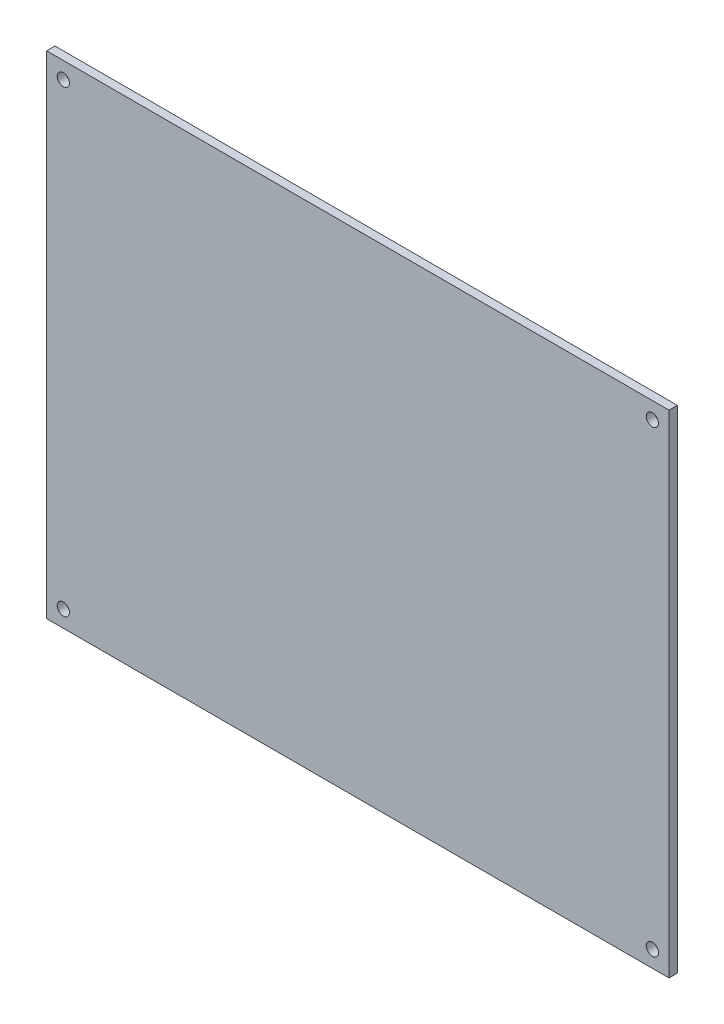
ISO-10303-21;
HEADER;
FILE_DESCRIPTION(('STEP AP214'),'2;1');
FILE_NAME('part.step','',(''),(''),'','','');
FILE_SCHEMA(('AUTOMOTIVE_DESIGN { 1 0 10303 214 1 1 1 1 }'));
ENDSEC;
DATA;
#1=APPLICATION_CONTEXT('core data for automotive mechanical design processes');
#2=APPLICATION_PROTOCOL_DEFINITION('international standard','automotive_design',2000,#1);
#3=PRODUCT_CONTEXT('',#1,'mechanical');
#4=PRODUCT('Part','Part','',(#3));
#5=PRODUCT_RELATED_PRODUCT_CATEGORY('part','',(#4));
#6=PRODUCT_DEFINITION_FORMATION('','',#4);
#7=PRODUCT_DEFINITION_CONTEXT('part definition',#1,'design');
#8=PRODUCT_DEFINITION('design','',#6,#7);
#9=PRODUCT_DEFINITION_SHAPE('','',#8);
#10=(LENGTH_UNIT() NAMED_UNIT(*) SI_UNIT(.MILLI.,.METRE.));
#11=(NAMED_UNIT(*) PLANE_ANGLE_UNIT() SI_UNIT($,.RADIAN.));
#12=(NAMED_UNIT(*) SI_UNIT($,.STERADIAN.) SOLID_ANGLE_UNIT());
#13=UNCERTAINTY_MEASURE_WITH_UNIT(LENGTH_MEASURE(1.E-05),#10,'distance_accuracy_value','');
#14=(GEOMETRIC_REPRESENTATION_CONTEXT(3) GLOBAL_UNCERTAINTY_ASSIGNED_CONTEXT((#13)) GLOBAL_UNIT_ASSIGNED_CONTEXT((#10,
#11,#12)) REPRESENTATION_CONTEXT('',''));
#15=CARTESIAN_POINT('',(0.,0.,0.));
#16=DIRECTION('',(0.,0.,1.));
#17=DIRECTION('',(1.,0.,0.));
#18=AXIS2_PLACEMENT_3D('',#15,#16,#17);
#19=CARTESIAN_POINT('',(56.,-44.25,1.5));
#20=DIRECTION('',(-1.,0.,0.));
#21=DIRECTION('',(0.,0.,1.));
#22=AXIS2_PLACEMENT_3D('',#19,#20,#21);
#23=PLANE('',#22);
#24=DIRECTION('',(0.,1.,0.));
#25=VECTOR('',#24,1.);
#26=CARTESIAN_POINT('',(56.,-44.25,0.));
#27=LINE('',#26,#25);
#28=CARTESIAN_POINT('',(56.,-44.25,0.));
#29=VERTEX_POINT('',#28);
#30=CARTESIAN_POINT('',(56.,44.25,0.));
#31=VERTEX_POINT('',#30);
#32=EDGE_CURVE('E98',#29,#31,#27,.T.);
#33=ORIENTED_EDGE('',*,*,#32,.T.);
#34=DIRECTION('',(0.,0.,-1.));
#35=VECTOR('',#34,1.);
#36=CARTESIAN_POINT('',(56.,44.25,1.5));
#37=LINE('',#36,#35);
#38=CARTESIAN_POINT('',(56.,44.25,1.5));
#39=VERTEX_POINT('',#38);
#40=EDGE_CURVE('E11',#39,#31,#37,.T.);
#41=ORIENTED_EDGE('',*,*,#40,.F.);
#42=DIRECTION('',(0.,1.,0.));
#43=VECTOR('',#42,1.);
#44=CARTESIAN_POINT('',(56.,-44.25,1.5));
#45=LINE('',#44,#43);
#46=CARTESIAN_POINT('',(56.,-44.25,1.5));
#47=VERTEX_POINT('',#46);
#48=EDGE_CURVE('E86',#47,#39,#45,.T.);
#49=ORIENTED_EDGE('',*,*,#48,.F.);
#50=DIRECTION('',(0.,0.,-1.));
#51=VECTOR('',#50,1.);
#52=CARTESIAN_POINT('',(56.,-44.25,1.5));
#53=LINE('',#52,#51);
#54=EDGE_CURVE('E94',#47,#29,#53,.T.);
#55=ORIENTED_EDGE('',*,*,#54,.T.);
#56=EDGE_LOOP('',(#33,#41,#49,#55));
#57=FACE_BOUND('',#56,.T.);
#58=ADVANCED_FACE('F35',(#57),#23,.F.);
#59=CARTESIAN_POINT('',(-56.,44.25,1.5));
#60=DIRECTION('',(0.,-1.,0.));
#61=DIRECTION('',(0.,0.,-1.));
#62=AXIS2_PLACEMENT_3D('',#59,#60,#61);
#63=PLANE('',#62);
#64=DIRECTION('',(-1.,0.,0.));
#65=VECTOR('',#64,1.);
#66=CARTESIAN_POINT('',(-56.,44.25,0.));
#67=LINE('',#66,#65);
#68=CARTESIAN_POINT('',(-56.,44.25,0.));
#69=VERTEX_POINT('',#68);
#70=EDGE_CURVE('E90',#31,#69,#67,.T.);
#71=ORIENTED_EDGE('',*,*,#70,.T.);
#72=DIRECTION('',(0.,0.,-1.));
#73=VECTOR('',#72,1.);
#74=CARTESIAN_POINT('',(-56.,44.25,1.5));
#75=LINE('',#74,#73);
#76=CARTESIAN_POINT('',(-56.,44.25,1.5));
#77=VERTEX_POINT('',#76);
#78=EDGE_CURVE('E43',#77,#69,#75,.T.);
#79=ORIENTED_EDGE('',*,*,#78,.F.);
#80=DIRECTION('',(-1.,0.,0.));
#81=VECTOR('',#80,1.);
#82=CARTESIAN_POINT('',(-56.,44.25,1.5));
#83=LINE('',#82,#81);
#84=EDGE_CURVE('E81',#39,#77,#83,.T.);
#85=ORIENTED_EDGE('',*,*,#84,.F.);
#86=ORIENTED_EDGE('',*,*,#40,.T.);
#87=EDGE_LOOP('',(#71,#79,#85,#86));
#88=FACE_BOUND('',#87,.T.);
#89=ADVANCED_FACE('F89',(#88),#63,.F.);
#90=CARTESIAN_POINT('',(-56.,-44.25,1.5));
#91=DIRECTION('',(1.,0.,0.));
#92=DIRECTION('',(0.,0.,-1.));
#93=AXIS2_PLACEMENT_3D('',#90,#91,#92);
#94=PLANE('',#93);
#95=DIRECTION('',(0.,-1.,0.));
#96=VECTOR('',#95,1.);
#97=CARTESIAN_POINT('',(-56.,-44.25,0.));
#98=LINE('',#97,#96);
#99=CARTESIAN_POINT('',(-56.,-44.25,0.));
#100=VERTEX_POINT('',#99);
#101=EDGE_CURVE('E68',#69,#100,#98,.T.);
#102=ORIENTED_EDGE('',*,*,#101,.T.);
#103=DIRECTION('',(0.,0.,-1.));
#104=VECTOR('',#103,1.);
#105=CARTESIAN_POINT('',(-56.,-44.25,1.5));
#106=LINE('',#105,#104);
#107=CARTESIAN_POINT('',(-56.,-44.25,1.5));
#108=VERTEX_POINT('',#107);
#109=EDGE_CURVE('E91',#108,#100,#106,.T.);
#110=ORIENTED_EDGE('',*,*,#109,.F.);
#111=DIRECTION('',(0.,-1.,0.));
#112=VECTOR('',#111,1.);
#113=CARTESIAN_POINT('',(-56.,-44.25,1.5));
#114=LINE('',#113,#112);
#115=EDGE_CURVE('E84',#77,#108,#114,.T.);
#116=ORIENTED_EDGE('',*,*,#115,.F.);
#117=ORIENTED_EDGE('',*,*,#78,.T.);
#118=EDGE_LOOP('',(#102,#110,#116,#117));
#119=FACE_BOUND('',#118,.T.);
#120=ADVANCED_FACE('F92',(#119),#94,.F.);
#121=CARTESIAN_POINT('',(-56.,-44.25,1.5));
#122=DIRECTION('',(0.,1.,0.));
#123=DIRECTION('',(0.,0.,1.));
#124=AXIS2_PLACEMENT_3D('',#121,#122,#123);
#125=PLANE('',#124);
#126=DIRECTION('',(1.,0.,0.));
#127=VECTOR('',#126,1.);
#128=CARTESIAN_POINT('',(-56.,-44.25,0.));
#129=LINE('',#128,#127);
#130=EDGE_CURVE('E74',#100,#29,#129,.T.);
#131=ORIENTED_EDGE('',*,*,#130,.T.);
#132=ORIENTED_EDGE('',*,*,#54,.F.);
#133=DIRECTION('',(1.,0.,0.));
#134=VECTOR('',#133,1.);
#135=CARTESIAN_POINT('',(-56.,-44.25,1.5));
#136=LINE('',#135,#134);
#137=EDGE_CURVE('E51',#108,#47,#136,.T.);
#138=ORIENTED_EDGE('',*,*,#137,.F.);
#139=ORIENTED_EDGE('',*,*,#109,.T.);
#140=EDGE_LOOP('',(#131,#132,#138,#139));
#141=FACE_BOUND('',#140,.T.);
#142=ADVANCED_FACE('F106',(#141),#125,.F.);
#143=CARTESIAN_POINT('',(0.,0.,1.5));
#144=DIRECTION('',(0.,0.,-1.));
#145=DIRECTION('',(-1.,0.,0.));
#146=AXIS2_PLACEMENT_3D('',#143,#144,#145);
#147=PLANE('',#146);
#148=CARTESIAN_POINT('',(-53.,-41.25,1.5));
#149=DIRECTION('',(0.,0.,1.));
#150=DIRECTION('',(1.,0.,0.));
#151=AXIS2_PLACEMENT_3D('',#148,#149,#150);
#152=CIRCLE('',#151,1.10000000000001);
#153=CARTESIAN_POINT('',(-51.9,-41.25,1.5));
#154=VERTEX_POINT('',#153);
#155=EDGE_CURVE('E118',#154,#154,#152,.T.);
#156=ORIENTED_EDGE('',*,*,#155,.F.);
#157=EDGE_LOOP('',(#156));
#158=FACE_BOUND('',#157,.T.);
#159=CARTESIAN_POINT('',(53.,-41.25,1.5));
#160=DIRECTION('',(0.,0.,1.));
#161=DIRECTION('',(1.,0.,0.));
#162=AXIS2_PLACEMENT_3D('',#159,#160,#161);
#163=CIRCLE('',#162,1.10000000000001);
#164=CARTESIAN_POINT('',(54.1,-41.25,1.5));
#165=VERTEX_POINT('',#164);
#166=EDGE_CURVE('E124',#165,#165,#163,.T.);
#167=ORIENTED_EDGE('',*,*,#166,.F.);
#168=EDGE_LOOP('',(#167));
#169=FACE_BOUND('',#168,.T.);
#170=CARTESIAN_POINT('',(53.,41.25,1.5));
#171=DIRECTION('',(0.,0.,1.));
#172=DIRECTION('',(1.,0.,0.));
#173=AXIS2_PLACEMENT_3D('',#170,#171,#172);
#174=CIRCLE('',#173,1.10000000000001);
#175=CARTESIAN_POINT('',(54.1,41.25,1.5));
#176=VERTEX_POINT('',#175);
#177=EDGE_CURVE('E130',#176,#176,#174,.T.);
#178=ORIENTED_EDGE('',*,*,#177,.F.);
#179=EDGE_LOOP('',(#178));
#180=FACE_BOUND('',#179,.T.);
#181=CARTESIAN_POINT('',(-53.,41.25,1.5));
#182=DIRECTION('',(0.,0.,1.));
#183=DIRECTION('',(1.,0.,0.));
#184=AXIS2_PLACEMENT_3D('',#181,#182,#183);
#185=CIRCLE('',#184,1.10000000000001);
#186=CARTESIAN_POINT('',(-51.9,41.25,1.5));
#187=VERTEX_POINT('',#186);
#188=EDGE_CURVE('E112',#187,#187,#185,.T.);
#189=ORIENTED_EDGE('',*,*,#188,.F.);
#190=EDGE_LOOP('',(#189));
#191=FACE_BOUND('',#190,.T.);
#192=ORIENTED_EDGE('',*,*,#48,.T.);
#193=ORIENTED_EDGE('',*,*,#84,.T.);
#194=ORIENTED_EDGE('',*,*,#115,.T.);
#195=ORIENTED_EDGE('',*,*,#137,.T.);
#196=EDGE_LOOP('',(#192,#193,#194,#195));
#197=FACE_BOUND('',#196,.T.);
#198=ADVANCED_FACE('F82',(#158,#169,#180,#191,#197),#147,.F.);
#199=CARTESIAN_POINT('',(0.,0.,0.));
#200=DIRECTION('',(0.,0.,-1.));
#201=DIRECTION('',(-1.,0.,0.));
#202=AXIS2_PLACEMENT_3D('',#199,#200,#201);
#203=PLANE('',#202);
#204=CARTESIAN_POINT('',(-53.,-41.25,0.));
#205=DIRECTION('',(0.,0.,1.));
#206=DIRECTION('',(1.,0.,0.));
#207=AXIS2_PLACEMENT_3D('',#204,#205,#206);
#208=CIRCLE('',#207,1.10000000000001);
#209=CARTESIAN_POINT('',(-51.9,-41.25,0.));
#210=VERTEX_POINT('',#209);
#211=EDGE_CURVE('E121',#210,#210,#208,.T.);
#212=ORIENTED_EDGE('',*,*,#211,.T.);
#213=EDGE_LOOP('',(#212));
#214=FACE_BOUND('',#213,.T.);
#215=CARTESIAN_POINT('',(53.,-41.25,0.));
#216=DIRECTION('',(0.,0.,1.));
#217=DIRECTION('',(1.,0.,0.));
#218=AXIS2_PLACEMENT_3D('',#215,#216,#217);
#219=CIRCLE('',#218,1.10000000000001);
#220=CARTESIAN_POINT('',(54.1,-41.25,0.));
#221=VERTEX_POINT('',#220);
#222=EDGE_CURVE('E127',#221,#221,#219,.T.);
#223=ORIENTED_EDGE('',*,*,#222,.T.);
#224=EDGE_LOOP('',(#223));
#225=FACE_BOUND('',#224,.T.);
#226=CARTESIAN_POINT('',(53.,41.25,0.));
#227=DIRECTION('',(0.,0.,1.));
#228=DIRECTION('',(1.,0.,0.));
#229=AXIS2_PLACEMENT_3D('',#226,#227,#228);
#230=CIRCLE('',#229,1.10000000000001);
#231=CARTESIAN_POINT('',(54.1,41.25,0.));
#232=VERTEX_POINT('',#231);
#233=EDGE_CURVE('E115',#232,#232,#230,.T.);
#234=ORIENTED_EDGE('',*,*,#233,.T.);
#235=EDGE_LOOP('',(#234));
#236=FACE_BOUND('',#235,.T.);
#237=CARTESIAN_POINT('',(-53.,41.25,0.));
#238=DIRECTION('',(0.,0.,1.));
#239=DIRECTION('',(1.,0.,0.));
#240=AXIS2_PLACEMENT_3D('',#237,#238,#239);
#241=CIRCLE('',#240,1.10000000000001);
#242=CARTESIAN_POINT('',(-51.9,41.25,0.));
#243=VERTEX_POINT('',#242);
#244=EDGE_CURVE('E101',#243,#243,#241,.T.);
#245=ORIENTED_EDGE('',*,*,#244,.T.);
#246=EDGE_LOOP('',(#245));
#247=FACE_BOUND('',#246,.T.);
#248=ORIENTED_EDGE('',*,*,#32,.F.);
#249=ORIENTED_EDGE('',*,*,#130,.F.);
#250=ORIENTED_EDGE('',*,*,#101,.F.);
#251=ORIENTED_EDGE('',*,*,#70,.F.);
#252=EDGE_LOOP('',(#248,#249,#250,#251));
#253=FACE_BOUND('',#252,.T.);
#254=ADVANCED_FACE('F109',(#214,#225,#236,#247,#253),#203,.T.);
#255=CARTESIAN_POINT('',(-53.,41.25,0.));
#256=DIRECTION('',(0.,0.,1.));
#257=DIRECTION('',(1.,0.,0.));
#258=AXIS2_PLACEMENT_3D('',#255,#256,#257);
#259=CYLINDRICAL_SURFACE('',#258,1.10000000000001);
#260=ORIENTED_EDGE('',*,*,#244,.F.);
#261=EDGE_LOOP('',(#260));
#262=FACE_BOUND('',#261,.T.);
#263=ORIENTED_EDGE('',*,*,#188,.T.);
#264=EDGE_LOOP('',(#263));
#265=FACE_BOUND('',#264,.T.);
#266=ADVANCED_FACE('F142',(#262,#265),#259,.F.);
#267=CARTESIAN_POINT('',(53.,41.25,0.));
#268=DIRECTION('',(0.,0.,1.));
#269=DIRECTION('',(1.,0.,0.));
#270=AXIS2_PLACEMENT_3D('',#267,#268,#269);
#271=CYLINDRICAL_SURFACE('',#270,1.10000000000001);
#272=ORIENTED_EDGE('',*,*,#233,.F.);
#273=EDGE_LOOP('',(#272));
#274=FACE_BOUND('',#273,.T.);
#275=ORIENTED_EDGE('',*,*,#177,.T.);
#276=EDGE_LOOP('',(#275));
#277=FACE_BOUND('',#276,.T.);
#278=ADVANCED_FACE('F138',(#274,#277),#271,.F.);
#279=CARTESIAN_POINT('',(53.,-41.25,0.));
#280=DIRECTION('',(0.,0.,1.));
#281=DIRECTION('',(1.,0.,0.));
#282=AXIS2_PLACEMENT_3D('',#279,#280,#281);
#283=CYLINDRICAL_SURFACE('',#282,1.10000000000001);
#284=ORIENTED_EDGE('',*,*,#222,.F.);
#285=EDGE_LOOP('',(#284));
#286=FACE_BOUND('',#285,.T.);
#287=ORIENTED_EDGE('',*,*,#166,.T.);
#288=EDGE_LOOP('',(#287));
#289=FACE_BOUND('',#288,.T.);
#290=ADVANCED_FACE('F141',(#286,#289),#283,.F.);
#291=CARTESIAN_POINT('',(-53.,-41.25,0.));
#292=DIRECTION('',(0.,0.,1.));
#293=DIRECTION('',(1.,0.,0.));
#294=AXIS2_PLACEMENT_3D('',#291,#292,#293);
#295=CYLINDRICAL_SURFACE('',#294,1.10000000000001);
#296=ORIENTED_EDGE('',*,*,#211,.F.);
#297=EDGE_LOOP('',(#296));
#298=FACE_BOUND('',#297,.T.);
#299=ORIENTED_EDGE('',*,*,#155,.T.);
#300=EDGE_LOOP('',(#299));
#301=FACE_BOUND('',#300,.T.);
#302=ADVANCED_FACE('F203',(#298,#301),#295,.F.);
#303=CLOSED_SHELL('',(#58,#89,#120,#142,#198,#254,#266,#278,#290,#302));
#304=MANIFOLD_SOLID_BREP('B2',#303);
#305=ADVANCED_BREP_SHAPE_REPRESENTATION('',(#18,#304),#14);
#306=SHAPE_DEFINITION_REPRESENTATION(#9,#305);
ENDSEC;
END-ISO-10303-21;
